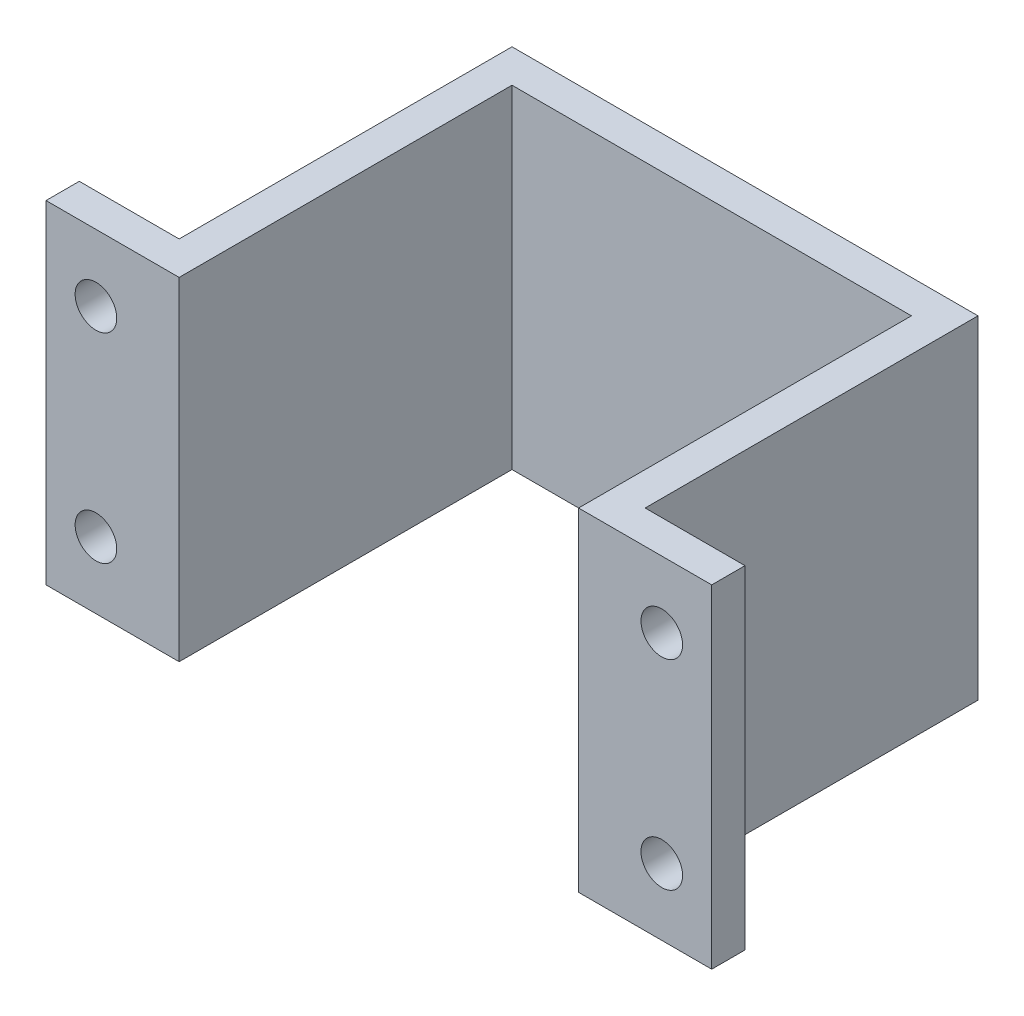
ISO-10303-21;
HEADER;
FILE_DESCRIPTION(('STEP AP214'),'2;1');
FILE_NAME('part.step','',(''),(''),'','','');
FILE_SCHEMA(('AUTOMOTIVE_DESIGN { 1 0 10303 214 1 1 1 1 }'));
ENDSEC;
DATA;
#1=APPLICATION_CONTEXT('core data for automotive mechanical design processes');
#2=APPLICATION_PROTOCOL_DEFINITION('international standard','automotive_design',2000,#1);
#3=PRODUCT_CONTEXT('',#1,'mechanical');
#4=PRODUCT('Part','Part','',(#3));
#5=PRODUCT_RELATED_PRODUCT_CATEGORY('part','',(#4));
#6=PRODUCT_DEFINITION_FORMATION('','',#4);
#7=PRODUCT_DEFINITION_CONTEXT('part definition',#1,'design');
#8=PRODUCT_DEFINITION('design','',#6,#7);
#9=PRODUCT_DEFINITION_SHAPE('','',#8);
#10=(LENGTH_UNIT() NAMED_UNIT(*) SI_UNIT(.MILLI.,.METRE.));
#11=(NAMED_UNIT(*) PLANE_ANGLE_UNIT() SI_UNIT($,.RADIAN.));
#12=(NAMED_UNIT(*) SI_UNIT($,.STERADIAN.) SOLID_ANGLE_UNIT());
#13=UNCERTAINTY_MEASURE_WITH_UNIT(LENGTH_MEASURE(1.E-05),#10,'distance_accuracy_value','');
#14=(GEOMETRIC_REPRESENTATION_CONTEXT(3) GLOBAL_UNCERTAINTY_ASSIGNED_CONTEXT((#13)) GLOBAL_UNIT_ASSIGNED_CONTEXT((#10,
#11,#12)) REPRESENTATION_CONTEXT('',''));
#15=CARTESIAN_POINT('',(0.,0.,0.));
#16=DIRECTION('',(0.,0.,1.));
#17=DIRECTION('',(1.,0.,0.));
#18=AXIS2_PLACEMENT_3D('',#15,#16,#17);
#19=CARTESIAN_POINT('',(-7.,10.,-11.));
#20=DIRECTION('',(1.,0.,0.));
#21=DIRECTION('',(0.,0.,-1.));
#22=AXIS2_PLACEMENT_3D('',#19,#20,#21);
#23=PLANE('',#22);
#24=DIRECTION('',(0.,0.,1.));
#25=VECTOR('',#24,1.);
#26=CARTESIAN_POINT('',(-7.,0.,-11.));
#27=LINE('',#26,#25);
#28=CARTESIAN_POINT('',(-7.,0.,-11.));
#29=VERTEX_POINT('',#28);
#30=CARTESIAN_POINT('',(-7.,0.,-1.));
#31=VERTEX_POINT('',#30);
#32=EDGE_CURVE('E161',#29,#31,#27,.T.);
#33=ORIENTED_EDGE('',*,*,#32,.T.);
#34=DIRECTION('',(0.,-1.,0.));
#35=VECTOR('',#34,1.);
#36=CARTESIAN_POINT('',(-7.,10.,-1.));
#37=LINE('',#36,#35);
#38=CARTESIAN_POINT('',(-7.,10.,-1.));
#39=VERTEX_POINT('',#38);
#40=EDGE_CURVE('E11',#39,#31,#37,.T.);
#41=ORIENTED_EDGE('',*,*,#40,.F.);
#42=DIRECTION('',(0.,0.,1.));
#43=VECTOR('',#42,1.);
#44=CARTESIAN_POINT('',(-7.,10.,-11.));
#45=LINE('',#44,#43);
#46=CARTESIAN_POINT('',(-7.,10.,-11.));
#47=VERTEX_POINT('',#46);
#48=EDGE_CURVE('E184',#47,#39,#45,.T.);
#49=ORIENTED_EDGE('',*,*,#48,.F.);
#50=DIRECTION('',(0.,-1.,0.));
#51=VECTOR('',#50,1.);
#52=CARTESIAN_POINT('',(-7.,10.,-11.));
#53=LINE('',#52,#51);
#54=EDGE_CURVE('E157',#47,#29,#53,.T.);
#55=ORIENTED_EDGE('',*,*,#54,.T.);
#56=EDGE_LOOP('',(#33,#41,#49,#55));
#57=FACE_BOUND('',#56,.T.);
#58=ADVANCED_FACE('F39',(#57),#23,.F.);
#59=CARTESIAN_POINT('',(-7.,10.,-1.));
#60=DIRECTION('',(0.,0.,1.));
#61=DIRECTION('',(1.,0.,0.));
#62=AXIS2_PLACEMENT_3D('',#59,#60,#61);
#63=PLANE('',#62);
#64=CARTESIAN_POINT('',(-8.5,8.,-1.00000000000001));
#65=DIRECTION('',(0.,0.,-1.));
#66=DIRECTION('',(-1.,0.,0.));
#67=AXIS2_PLACEMENT_3D('',#64,#65,#66);
#68=CIRCLE('',#67,0.624999999999999);
#69=CARTESIAN_POINT('',(-9.125,8.,-1.00000000000001));
#70=VERTEX_POINT('',#69);
#71=EDGE_CURVE('E220',#70,#70,#68,.T.);
#72=ORIENTED_EDGE('',*,*,#71,.F.);
#73=EDGE_LOOP('',(#72));
#74=FACE_BOUND('',#73,.T.);
#75=CARTESIAN_POINT('',(-8.5,2.,-1.00000000000001));
#76=DIRECTION('',(0.,0.,-1.));
#77=DIRECTION('',(-1.,0.,0.));
#78=AXIS2_PLACEMENT_3D('',#75,#76,#77);
#79=CIRCLE('',#78,0.624999999999999);
#80=CARTESIAN_POINT('',(-9.125,2.,-1.00000000000001));
#81=VERTEX_POINT('',#80);
#82=EDGE_CURVE('E210',#81,#81,#79,.T.);
#83=ORIENTED_EDGE('',*,*,#82,.F.);
#84=EDGE_LOOP('',(#83));
#85=FACE_BOUND('',#84,.T.);
#86=DIRECTION('',(-1.,0.,0.));
#87=VECTOR('',#86,1.);
#88=CARTESIAN_POINT('',(-7.,0.,-1.));
#89=LINE('',#88,#87);
#90=CARTESIAN_POINT('',(-10.,0.,-1.));
#91=VERTEX_POINT('',#90);
#92=EDGE_CURVE('E164',#31,#91,#89,.T.);
#93=ORIENTED_EDGE('',*,*,#92,.T.);
#94=DIRECTION('',(0.,-1.,0.));
#95=VECTOR('',#94,1.);
#96=CARTESIAN_POINT('',(-10.,10.,-1.));
#97=LINE('',#96,#95);
#98=CARTESIAN_POINT('',(-10.,10.,-1.));
#99=VERTEX_POINT('',#98);
#100=EDGE_CURVE('E48',#99,#91,#97,.T.);
#101=ORIENTED_EDGE('',*,*,#100,.F.);
#102=DIRECTION('',(-1.,0.,0.));
#103=VECTOR('',#102,1.);
#104=CARTESIAN_POINT('',(-7.,10.,-1.));
#105=LINE('',#104,#103);
#106=EDGE_CURVE('E112',#39,#99,#105,.T.);
#107=ORIENTED_EDGE('',*,*,#106,.F.);
#108=ORIENTED_EDGE('',*,*,#40,.T.);
#109=EDGE_LOOP('',(#93,#101,#107,#108));
#110=FACE_BOUND('',#109,.T.);
#111=ADVANCED_FACE('F267',(#74,#85,#110),#63,.F.);
#112=CARTESIAN_POINT('',(-10.,10.,-1.));
#113=DIRECTION('',(1.,0.,0.));
#114=DIRECTION('',(0.,0.,-1.));
#115=AXIS2_PLACEMENT_3D('',#112,#113,#114);
#116=PLANE('',#115);
#117=DIRECTION('',(0.,0.,1.));
#118=VECTOR('',#117,1.);
#119=CARTESIAN_POINT('',(-10.,0.,-1.));
#120=LINE('',#119,#118);
#121=CARTESIAN_POINT('',(-10.,0.,0.));
#122=VERTEX_POINT('',#121);
#123=EDGE_CURVE('E167',#91,#122,#120,.T.);
#124=ORIENTED_EDGE('',*,*,#123,.T.);
#125=DIRECTION('',(0.,-1.,0.));
#126=VECTOR('',#125,1.);
#127=CARTESIAN_POINT('',(-10.,10.,0.));
#128=LINE('',#127,#126);
#129=CARTESIAN_POINT('',(-10.,10.,0.));
#130=VERTEX_POINT('',#129);
#131=EDGE_CURVE('E203',#130,#122,#128,.T.);
#132=ORIENTED_EDGE('',*,*,#131,.F.);
#133=DIRECTION('',(0.,0.,1.));
#134=VECTOR('',#133,1.);
#135=CARTESIAN_POINT('',(-10.,10.,-1.));
#136=LINE('',#135,#134);
#137=EDGE_CURVE('E228',#99,#130,#136,.T.);
#138=ORIENTED_EDGE('',*,*,#137,.F.);
#139=ORIENTED_EDGE('',*,*,#100,.T.);
#140=EDGE_LOOP('',(#124,#132,#138,#139));
#141=FACE_BOUND('',#140,.T.);
#142=ADVANCED_FACE('F271',(#141),#116,.F.);
#143=CARTESIAN_POINT('',(-10.,10.,0.));
#144=DIRECTION('',(0.,0.,-1.));
#145=DIRECTION('',(-1.,0.,0.));
#146=AXIS2_PLACEMENT_3D('',#143,#144,#145);
#147=PLANE('',#146);
#148=CARTESIAN_POINT('',(-8.5,8.,0.));
#149=DIRECTION('',(0.,0.,-1.));
#150=DIRECTION('',(-1.,0.,0.));
#151=AXIS2_PLACEMENT_3D('',#148,#149,#150);
#152=CIRCLE('',#151,0.624999999999998);
#153=CARTESIAN_POINT('',(-9.125,8.,0.));
#154=VERTEX_POINT('',#153);
#155=EDGE_CURVE('E42',#154,#154,#152,.T.);
#156=ORIENTED_EDGE('',*,*,#155,.T.);
#157=EDGE_LOOP('',(#156));
#158=FACE_BOUND('',#157,.T.);
#159=CARTESIAN_POINT('',(-8.5,2.,0.));
#160=DIRECTION('',(0.,0.,-1.));
#161=DIRECTION('',(-1.,0.,0.));
#162=AXIS2_PLACEMENT_3D('',#159,#160,#161);
#163=CIRCLE('',#162,0.624999999999998);
#164=CARTESIAN_POINT('',(-9.125,2.,0.));
#165=VERTEX_POINT('',#164);
#166=EDGE_CURVE('E207',#165,#165,#163,.T.);
#167=ORIENTED_EDGE('',*,*,#166,.T.);
#168=EDGE_LOOP('',(#167));
#169=FACE_BOUND('',#168,.T.);
#170=DIRECTION('',(1.,0.,0.));
#171=VECTOR('',#170,1.);
#172=CARTESIAN_POINT('',(-10.,0.,0.));
#173=LINE('',#172,#171);
#174=CARTESIAN_POINT('',(-6.,0.,0.));
#175=VERTEX_POINT('',#174);
#176=EDGE_CURVE('E169',#122,#175,#173,.T.);
#177=ORIENTED_EDGE('',*,*,#176,.T.);
#178=DIRECTION('',(0.,-1.,0.));
#179=VECTOR('',#178,1.);
#180=CARTESIAN_POINT('',(-6.,10.,0.));
#181=LINE('',#180,#179);
#182=CARTESIAN_POINT('',(-6.,10.,0.));
#183=VERTEX_POINT('',#182);
#184=EDGE_CURVE('E200',#183,#175,#181,.T.);
#185=ORIENTED_EDGE('',*,*,#184,.F.);
#186=DIRECTION('',(1.,0.,0.));
#187=VECTOR('',#186,1.);
#188=CARTESIAN_POINT('',(-10.,10.,0.));
#189=LINE('',#188,#187);
#190=EDGE_CURVE('E230',#130,#183,#189,.T.);
#191=ORIENTED_EDGE('',*,*,#190,.F.);
#192=ORIENTED_EDGE('',*,*,#131,.T.);
#193=EDGE_LOOP('',(#177,#185,#191,#192));
#194=FACE_BOUND('',#193,.T.);
#195=ADVANCED_FACE('F276',(#158,#169,#194),#147,.F.);
#196=CARTESIAN_POINT('',(-6.,10.,0.));
#197=DIRECTION('',(-1.,0.,0.));
#198=DIRECTION('',(0.,0.,1.));
#199=AXIS2_PLACEMENT_3D('',#196,#197,#198);
#200=PLANE('',#199);
#201=DIRECTION('',(0.,0.,-1.));
#202=VECTOR('',#201,1.);
#203=CARTESIAN_POINT('',(-6.,0.,0.));
#204=LINE('',#203,#202);
#205=CARTESIAN_POINT('',(-6.,0.,-10.));
#206=VERTEX_POINT('',#205);
#207=EDGE_CURVE('E171',#175,#206,#204,.T.);
#208=ORIENTED_EDGE('',*,*,#207,.T.);
#209=DIRECTION('',(0.,-1.,0.));
#210=VECTOR('',#209,1.);
#211=CARTESIAN_POINT('',(-6.,10.,-10.));
#212=LINE('',#211,#210);
#213=CARTESIAN_POINT('',(-6.,10.,-10.));
#214=VERTEX_POINT('',#213);
#215=EDGE_CURVE('E197',#214,#206,#212,.T.);
#216=ORIENTED_EDGE('',*,*,#215,.F.);
#217=DIRECTION('',(0.,0.,-1.));
#218=VECTOR('',#217,1.);
#219=CARTESIAN_POINT('',(-6.,10.,0.));
#220=LINE('',#219,#218);
#221=EDGE_CURVE('E232',#183,#214,#220,.T.);
#222=ORIENTED_EDGE('',*,*,#221,.F.);
#223=ORIENTED_EDGE('',*,*,#184,.T.);
#224=EDGE_LOOP('',(#208,#216,#222,#223));
#225=FACE_BOUND('',#224,.T.);
#226=ADVANCED_FACE('F284',(#225),#200,.F.);
#227=CARTESIAN_POINT('',(-6.,10.,-10.));
#228=DIRECTION('',(0.,0.,-1.));
#229=DIRECTION('',(-1.,0.,0.));
#230=AXIS2_PLACEMENT_3D('',#227,#228,#229);
#231=PLANE('',#230);
#232=DIRECTION('',(1.,0.,0.));
#233=VECTOR('',#232,1.);
#234=CARTESIAN_POINT('',(-6.,0.,-10.));
#235=LINE('',#234,#233);
#236=CARTESIAN_POINT('',(6.,0.,-10.));
#237=VERTEX_POINT('',#236);
#238=EDGE_CURVE('E173',#206,#237,#235,.T.);
#239=ORIENTED_EDGE('',*,*,#238,.T.);
#240=DIRECTION('',(0.,-1.,0.));
#241=VECTOR('',#240,1.);
#242=CARTESIAN_POINT('',(6.,10.,-10.));
#243=LINE('',#242,#241);
#244=CARTESIAN_POINT('',(6.,10.,-10.));
#245=VERTEX_POINT('',#244);
#246=EDGE_CURVE('E194',#245,#237,#243,.T.);
#247=ORIENTED_EDGE('',*,*,#246,.F.);
#248=DIRECTION('',(1.,0.,0.));
#249=VECTOR('',#248,1.);
#250=CARTESIAN_POINT('',(-6.,10.,-10.));
#251=LINE('',#250,#249);
#252=EDGE_CURVE('E234',#214,#245,#251,.T.);
#253=ORIENTED_EDGE('',*,*,#252,.F.);
#254=ORIENTED_EDGE('',*,*,#215,.T.);
#255=EDGE_LOOP('',(#239,#247,#253,#254));
#256=FACE_BOUND('',#255,.T.);
#257=ADVANCED_FACE('F288',(#256),#231,.F.);
#258=CARTESIAN_POINT('',(6.,10.,0.));
#259=DIRECTION('',(1.,0.,0.));
#260=DIRECTION('',(0.,0.,-1.));
#261=AXIS2_PLACEMENT_3D('',#258,#259,#260);
#262=PLANE('',#261);
#263=DIRECTION('',(0.,0.,1.));
#264=VECTOR('',#263,1.);
#265=CARTESIAN_POINT('',(6.,0.,0.));
#266=LINE('',#265,#264);
#267=CARTESIAN_POINT('',(6.,0.,0.));
#268=VERTEX_POINT('',#267);
#269=EDGE_CURVE('E175',#237,#268,#266,.T.);
#270=ORIENTED_EDGE('',*,*,#269,.T.);
#271=DIRECTION('',(0.,-1.,0.));
#272=VECTOR('',#271,1.);
#273=CARTESIAN_POINT('',(6.,10.,0.));
#274=LINE('',#273,#272);
#275=CARTESIAN_POINT('',(6.,10.,0.));
#276=VERTEX_POINT('',#275);
#277=EDGE_CURVE('E191',#276,#268,#274,.T.);
#278=ORIENTED_EDGE('',*,*,#277,.F.);
#279=DIRECTION('',(0.,0.,1.));
#280=VECTOR('',#279,1.);
#281=CARTESIAN_POINT('',(6.,10.,0.));
#282=LINE('',#281,#280);
#283=EDGE_CURVE('E236',#245,#276,#282,.T.);
#284=ORIENTED_EDGE('',*,*,#283,.F.);
#285=ORIENTED_EDGE('',*,*,#246,.T.);
#286=EDGE_LOOP('',(#270,#278,#284,#285));
#287=FACE_BOUND('',#286,.T.);
#288=ADVANCED_FACE('F292',(#287),#262,.F.);
#289=CARTESIAN_POINT('',(10.,10.,0.));
#290=DIRECTION('',(0.,0.,-1.));
#291=DIRECTION('',(-1.,0.,0.));
#292=AXIS2_PLACEMENT_3D('',#289,#290,#291);
#293=PLANE('',#292);
#294=CARTESIAN_POINT('',(8.5,8.,0.));
#295=DIRECTION('',(0.,0.,-1.));
#296=DIRECTION('',(-1.,0.,0.));
#297=AXIS2_PLACEMENT_3D('',#294,#295,#296);
#298=CIRCLE('',#297,0.624999999999998);
#299=CARTESIAN_POINT('',(7.875,8.,0.));
#300=VERTEX_POINT('',#299);
#301=EDGE_CURVE('E337',#300,#300,#298,.T.);
#302=ORIENTED_EDGE('',*,*,#301,.T.);
#303=EDGE_LOOP('',(#302));
#304=FACE_BOUND('',#303,.T.);
#305=CARTESIAN_POINT('',(8.5,2.,0.));
#306=DIRECTION('',(0.,0.,-1.));
#307=DIRECTION('',(-1.,0.,0.));
#308=AXIS2_PLACEMENT_3D('',#305,#306,#307);
#309=CIRCLE('',#308,0.624999999999998);
#310=CARTESIAN_POINT('',(7.875,2.,0.));
#311=VERTEX_POINT('',#310);
#312=EDGE_CURVE('E165',#311,#311,#309,.T.);
#313=ORIENTED_EDGE('',*,*,#312,.T.);
#314=EDGE_LOOP('',(#313));
#315=FACE_BOUND('',#314,.T.);
#316=DIRECTION('',(1.,0.,0.));
#317=VECTOR('',#316,1.);
#318=CARTESIAN_POINT('',(10.,0.,0.));
#319=LINE('',#318,#317);
#320=CARTESIAN_POINT('',(10.,0.,0.));
#321=VERTEX_POINT('',#320);
#322=EDGE_CURVE('E177',#268,#321,#319,.T.);
#323=ORIENTED_EDGE('',*,*,#322,.T.);
#324=DIRECTION('',(0.,-1.,0.));
#325=VECTOR('',#324,1.);
#326=CARTESIAN_POINT('',(10.,10.,0.));
#327=LINE('',#326,#325);
#328=CARTESIAN_POINT('',(10.,10.,0.));
#329=VERTEX_POINT('',#328);
#330=EDGE_CURVE('E188',#329,#321,#327,.T.);
#331=ORIENTED_EDGE('',*,*,#330,.F.);
#332=DIRECTION('',(1.,0.,0.));
#333=VECTOR('',#332,1.);
#334=CARTESIAN_POINT('',(10.,10.,0.));
#335=LINE('',#334,#333);
#336=EDGE_CURVE('E238',#276,#329,#335,.T.);
#337=ORIENTED_EDGE('',*,*,#336,.F.);
#338=ORIENTED_EDGE('',*,*,#277,.T.);
#339=EDGE_LOOP('',(#323,#331,#337,#338));
#340=FACE_BOUND('',#339,.T.);
#341=ADVANCED_FACE('F244',(#304,#315,#340),#293,.F.);
#342=CARTESIAN_POINT('',(10.,10.,-1.));
#343=DIRECTION('',(-1.,0.,0.));
#344=DIRECTION('',(0.,0.,1.));
#345=AXIS2_PLACEMENT_3D('',#342,#343,#344);
#346=PLANE('',#345);
#347=DIRECTION('',(0.,0.,-1.));
#348=VECTOR('',#347,1.);
#349=CARTESIAN_POINT('',(10.,0.,-1.));
#350=LINE('',#349,#348);
#351=CARTESIAN_POINT('',(10.,0.,-1.));
#352=VERTEX_POINT('',#351);
#353=EDGE_CURVE('E179',#321,#352,#350,.T.);
#354=ORIENTED_EDGE('',*,*,#353,.T.);
#355=DIRECTION('',(0.,-1.,0.));
#356=VECTOR('',#355,1.);
#357=CARTESIAN_POINT('',(10.,10.,-1.));
#358=LINE('',#357,#356);
#359=CARTESIAN_POINT('',(10.,10.,-1.));
#360=VERTEX_POINT('',#359);
#361=EDGE_CURVE('E152',#360,#352,#358,.T.);
#362=ORIENTED_EDGE('',*,*,#361,.F.);
#363=DIRECTION('',(0.,0.,-1.));
#364=VECTOR('',#363,1.);
#365=CARTESIAN_POINT('',(10.,10.,-1.));
#366=LINE('',#365,#364);
#367=EDGE_CURVE('E143',#329,#360,#366,.T.);
#368=ORIENTED_EDGE('',*,*,#367,.F.);
#369=ORIENTED_EDGE('',*,*,#330,.T.);
#370=EDGE_LOOP('',(#354,#362,#368,#369));
#371=FACE_BOUND('',#370,.T.);
#372=ADVANCED_FACE('F248',(#371),#346,.F.);
#373=CARTESIAN_POINT('',(7.,10.,-1.));
#374=DIRECTION('',(0.,0.,1.));
#375=DIRECTION('',(1.,0.,0.));
#376=AXIS2_PLACEMENT_3D('',#373,#374,#375);
#377=PLANE('',#376);
#378=CARTESIAN_POINT('',(8.5,8.,-0.999999999999994));
#379=DIRECTION('',(0.,0.,-1.));
#380=DIRECTION('',(-1.,0.,0.));
#381=AXIS2_PLACEMENT_3D('',#378,#379,#380);
#382=CIRCLE('',#381,0.624999999999999);
#383=CARTESIAN_POINT('',(7.875,8.,-0.999999999999994));
#384=VERTEX_POINT('',#383);
#385=EDGE_CURVE('E309',#384,#384,#382,.T.);
#386=ORIENTED_EDGE('',*,*,#385,.F.);
#387=EDGE_LOOP('',(#386));
#388=FACE_BOUND('',#387,.T.);
#389=CARTESIAN_POINT('',(8.5,2.,-0.999999999999994));
#390=DIRECTION('',(0.,0.,-1.));
#391=DIRECTION('',(-1.,0.,0.));
#392=AXIS2_PLACEMENT_3D('',#389,#390,#391);
#393=CIRCLE('',#392,0.624999999999999);
#394=CARTESIAN_POINT('',(7.875,2.,-0.999999999999994));
#395=VERTEX_POINT('',#394);
#396=EDGE_CURVE('E209',#395,#395,#393,.T.);
#397=ORIENTED_EDGE('',*,*,#396,.F.);
#398=EDGE_LOOP('',(#397));
#399=FACE_BOUND('',#398,.T.);
#400=DIRECTION('',(-1.,0.,0.));
#401=VECTOR('',#400,1.);
#402=CARTESIAN_POINT('',(7.,0.,-1.));
#403=LINE('',#402,#401);
#404=CARTESIAN_POINT('',(7.,0.,-1.));
#405=VERTEX_POINT('',#404);
#406=EDGE_CURVE('E151',#352,#405,#403,.T.);
#407=ORIENTED_EDGE('',*,*,#406,.T.);
#408=DIRECTION('',(0.,-1.,0.));
#409=VECTOR('',#408,1.);
#410=CARTESIAN_POINT('',(7.,10.,-1.));
#411=LINE('',#410,#409);
#412=CARTESIAN_POINT('',(7.,10.,-1.));
#413=VERTEX_POINT('',#412);
#414=EDGE_CURVE('E148',#413,#405,#411,.T.);
#415=ORIENTED_EDGE('',*,*,#414,.F.);
#416=DIRECTION('',(-1.,0.,0.));
#417=VECTOR('',#416,1.);
#418=CARTESIAN_POINT('',(7.,10.,-1.));
#419=LINE('',#418,#417);
#420=EDGE_CURVE('E137',#360,#413,#419,.T.);
#421=ORIENTED_EDGE('',*,*,#420,.F.);
#422=ORIENTED_EDGE('',*,*,#361,.T.);
#423=EDGE_LOOP('',(#407,#415,#421,#422));
#424=FACE_BOUND('',#423,.T.);
#425=ADVANCED_FACE('F149',(#388,#399,#424),#377,.F.);
#426=CARTESIAN_POINT('',(7.,10.,-11.));
#427=DIRECTION('',(-1.,0.,0.));
#428=DIRECTION('',(0.,0.,1.));
#429=AXIS2_PLACEMENT_3D('',#426,#427,#428);
#430=PLANE('',#429);
#431=DIRECTION('',(0.,0.,-1.));
#432=VECTOR('',#431,1.);
#433=CARTESIAN_POINT('',(7.,0.,-11.));
#434=LINE('',#433,#432);
#435=CARTESIAN_POINT('',(7.,0.,-11.));
#436=VERTEX_POINT('',#435);
#437=EDGE_CURVE('E98',#405,#436,#434,.T.);
#438=ORIENTED_EDGE('',*,*,#437,.T.);
#439=DIRECTION('',(0.,-1.,0.));
#440=VECTOR('',#439,1.);
#441=CARTESIAN_POINT('',(7.,10.,-11.));
#442=LINE('',#441,#440);
#443=CARTESIAN_POINT('',(7.,10.,-11.));
#444=VERTEX_POINT('',#443);
#445=EDGE_CURVE('E153',#444,#436,#442,.T.);
#446=ORIENTED_EDGE('',*,*,#445,.F.);
#447=DIRECTION('',(0.,0.,-1.));
#448=VECTOR('',#447,1.);
#449=CARTESIAN_POINT('',(7.,10.,-11.));
#450=LINE('',#449,#448);
#451=EDGE_CURVE('E141',#413,#444,#450,.T.);
#452=ORIENTED_EDGE('',*,*,#451,.F.);
#453=ORIENTED_EDGE('',*,*,#414,.T.);
#454=EDGE_LOOP('',(#438,#446,#452,#453));
#455=FACE_BOUND('',#454,.T.);
#456=ADVANCED_FACE('F155',(#455),#430,.F.);
#457=CARTESIAN_POINT('',(7.,10.,-11.));
#458=DIRECTION('',(0.,0.,1.));
#459=DIRECTION('',(1.,0.,0.));
#460=AXIS2_PLACEMENT_3D('',#457,#458,#459);
#461=PLANE('',#460);
#462=DIRECTION('',(-1.,0.,0.));
#463=VECTOR('',#462,1.);
#464=CARTESIAN_POINT('',(7.,0.,-11.));
#465=LINE('',#464,#463);
#466=EDGE_CURVE('E104',#436,#29,#465,.T.);
#467=ORIENTED_EDGE('',*,*,#466,.T.);
#468=ORIENTED_EDGE('',*,*,#54,.F.);
#469=DIRECTION('',(-1.,0.,0.));
#470=VECTOR('',#469,1.);
#471=CARTESIAN_POINT('',(7.,10.,-11.));
#472=LINE('',#471,#470);
#473=EDGE_CURVE('E57',#444,#47,#472,.T.);
#474=ORIENTED_EDGE('',*,*,#473,.F.);
#475=ORIENTED_EDGE('',*,*,#445,.T.);
#476=EDGE_LOOP('',(#467,#468,#474,#475));
#477=FACE_BOUND('',#476,.T.);
#478=ADVANCED_FACE('F256',(#477),#461,.F.);
#479=CARTESIAN_POINT('',(0.,10.,0.));
#480=DIRECTION('',(0.,-1.,0.));
#481=DIRECTION('',(0.,0.,-1.));
#482=AXIS2_PLACEMENT_3D('',#479,#480,#481);
#483=PLANE('',#482);
#484=ORIENTED_EDGE('',*,*,#48,.T.);
#485=ORIENTED_EDGE('',*,*,#106,.T.);
#486=ORIENTED_EDGE('',*,*,#137,.T.);
#487=ORIENTED_EDGE('',*,*,#190,.T.);
#488=ORIENTED_EDGE('',*,*,#221,.T.);
#489=ORIENTED_EDGE('',*,*,#252,.T.);
#490=ORIENTED_EDGE('',*,*,#283,.T.);
#491=ORIENTED_EDGE('',*,*,#336,.T.);
#492=ORIENTED_EDGE('',*,*,#367,.T.);
#493=ORIENTED_EDGE('',*,*,#420,.T.);
#494=ORIENTED_EDGE('',*,*,#451,.T.);
#495=ORIENTED_EDGE('',*,*,#473,.T.);
#496=EDGE_LOOP('',(#484,#485,#486,#487,#488,#489,#490,#491,#492,#493,#494,#495));
#497=FACE_BOUND('',#496,.T.);
#498=ADVANCED_FACE('F139',(#497),#483,.F.);
#499=CARTESIAN_POINT('',(0.,0.,0.));
#500=DIRECTION('',(0.,-1.,0.));
#501=DIRECTION('',(0.,0.,-1.));
#502=AXIS2_PLACEMENT_3D('',#499,#500,#501);
#503=PLANE('',#502);
#504=ORIENTED_EDGE('',*,*,#32,.F.);
#505=ORIENTED_EDGE('',*,*,#466,.F.);
#506=ORIENTED_EDGE('',*,*,#437,.F.);
#507=ORIENTED_EDGE('',*,*,#406,.F.);
#508=ORIENTED_EDGE('',*,*,#353,.F.);
#509=ORIENTED_EDGE('',*,*,#322,.F.);
#510=ORIENTED_EDGE('',*,*,#269,.F.);
#511=ORIENTED_EDGE('',*,*,#238,.F.);
#512=ORIENTED_EDGE('',*,*,#207,.F.);
#513=ORIENTED_EDGE('',*,*,#176,.F.);
#514=ORIENTED_EDGE('',*,*,#123,.F.);
#515=ORIENTED_EDGE('',*,*,#92,.F.);
#516=EDGE_LOOP('',(#504,#505,#506,#507,#508,#509,#510,#511,#512,#513,#514,#515));
#517=FACE_BOUND('',#516,.T.);
#518=ADVANCED_FACE('F251',(#517),#503,.T.);
#519=CARTESIAN_POINT('',(8.5,2.,-0.999999999999994));
#520=DIRECTION('',(0.,0.,-1.));
#521=DIRECTION('',(-1.,0.,0.));
#522=AXIS2_PLACEMENT_3D('',#519,#520,#521);
#523=CYLINDRICAL_SURFACE('',#522,0.624999999999998);
#524=ORIENTED_EDGE('',*,*,#396,.T.);
#525=EDGE_LOOP('',(#524));
#526=FACE_BOUND('',#525,.T.);
#527=ORIENTED_EDGE('',*,*,#312,.F.);
#528=EDGE_LOOP('',(#527));
#529=FACE_BOUND('',#528,.T.);
#530=ADVANCED_FACE('F312',(#526,#529),#523,.F.);
#531=CARTESIAN_POINT('',(-8.5,2.,-1.00000000000001));
#532=DIRECTION('',(0.,0.,-1.));
#533=DIRECTION('',(-1.,0.,0.));
#534=AXIS2_PLACEMENT_3D('',#531,#532,#533);
#535=CYLINDRICAL_SURFACE('',#534,0.624999999999998);
#536=ORIENTED_EDGE('',*,*,#82,.T.);
#537=EDGE_LOOP('',(#536));
#538=FACE_BOUND('',#537,.T.);
#539=ORIENTED_EDGE('',*,*,#166,.F.);
#540=EDGE_LOOP('',(#539));
#541=FACE_BOUND('',#540,.T.);
#542=ADVANCED_FACE('F315',(#538,#541),#535,.F.);
#543=CARTESIAN_POINT('',(-8.5,8.,-1.00000000000001));
#544=DIRECTION('',(0.,0.,-1.));
#545=DIRECTION('',(-1.,0.,0.));
#546=AXIS2_PLACEMENT_3D('',#543,#544,#545);
#547=CYLINDRICAL_SURFACE('',#546,0.624999999999998);
#548=ORIENTED_EDGE('',*,*,#71,.T.);
#549=EDGE_LOOP('',(#548));
#550=FACE_BOUND('',#549,.T.);
#551=ORIENTED_EDGE('',*,*,#155,.F.);
#552=EDGE_LOOP('',(#551));
#553=FACE_BOUND('',#552,.T.);
#554=ADVANCED_FACE('F323',(#550,#553),#547,.F.);
#555=CARTESIAN_POINT('',(8.5,8.,-0.999999999999994));
#556=DIRECTION('',(0.,0.,-1.));
#557=DIRECTION('',(-1.,0.,0.));
#558=AXIS2_PLACEMENT_3D('',#555,#556,#557);
#559=CYLINDRICAL_SURFACE('',#558,0.624999999999998);
#560=ORIENTED_EDGE('',*,*,#385,.T.);
#561=EDGE_LOOP('',(#560));
#562=FACE_BOUND('',#561,.T.);
#563=ORIENTED_EDGE('',*,*,#301,.F.);
#564=EDGE_LOOP('',(#563));
#565=FACE_BOUND('',#564,.T.);
#566=ADVANCED_FACE('F328',(#562,#565),#559,.F.);
#567=CLOSED_SHELL('',(#58,#111,#142,#195,#226,#257,#288,#341,#372,#425,#456,#478,#498,#518,#530,
#542,#554,#566));
#568=MANIFOLD_SOLID_BREP('B2',#567);
#569=ADVANCED_BREP_SHAPE_REPRESENTATION('',(#18,#568),#14);
#570=SHAPE_DEFINITION_REPRESENTATION(#9,#569);
ENDSEC;
END-ISO-10303-21;
